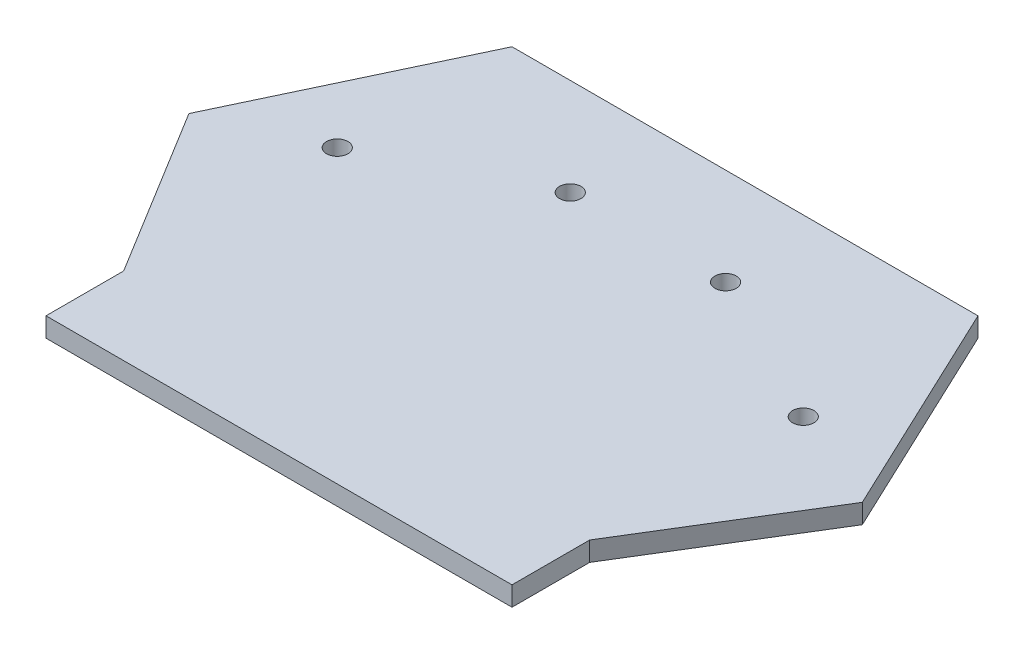
ISO-10303-21;
HEADER;
FILE_DESCRIPTION(('STEP AP214'),'2;1');
FILE_NAME('part.step','',(''),(''),'','','');
FILE_SCHEMA(('AUTOMOTIVE_DESIGN { 1 0 10303 214 1 1 1 1 }'));
ENDSEC;
DATA;
#1=APPLICATION_CONTEXT('core data for automotive mechanical design processes');
#2=APPLICATION_PROTOCOL_DEFINITION('international standard','automotive_design',2000,#1);
#3=PRODUCT_CONTEXT('',#1,'mechanical');
#4=PRODUCT('Part','Part','',(#3));
#5=PRODUCT_RELATED_PRODUCT_CATEGORY('part','',(#4));
#6=PRODUCT_DEFINITION_FORMATION('','',#4);
#7=PRODUCT_DEFINITION_CONTEXT('part definition',#1,'design');
#8=PRODUCT_DEFINITION('design','',#6,#7);
#9=PRODUCT_DEFINITION_SHAPE('','',#8);
#10=(LENGTH_UNIT() NAMED_UNIT(*) SI_UNIT(.MILLI.,.METRE.));
#11=(NAMED_UNIT(*) PLANE_ANGLE_UNIT() SI_UNIT($,.RADIAN.));
#12=(NAMED_UNIT(*) SI_UNIT($,.STERADIAN.) SOLID_ANGLE_UNIT());
#13=UNCERTAINTY_MEASURE_WITH_UNIT(LENGTH_MEASURE(1.E-05),#10,'distance_accuracy_value','');
#14=(GEOMETRIC_REPRESENTATION_CONTEXT(3) GLOBAL_UNCERTAINTY_ASSIGNED_CONTEXT((#13)) GLOBAL_UNIT_ASSIGNED_CONTEXT((#10,
#11,#12)) REPRESENTATION_CONTEXT('',''));
#15=CARTESIAN_POINT('',(0.,0.,0.));
#16=DIRECTION('',(0.,0.,1.));
#17=DIRECTION('',(1.,0.,0.));
#18=AXIS2_PLACEMENT_3D('',#15,#16,#17);
#19=CARTESIAN_POINT('',(-99.2676573240206,5.,-46.9170895914939));
#20=DIRECTION('',(-0.904105481449847,0.,-0.427309347443208));
#21=DIRECTION('',(-0.427309347443208,0.,0.904105481449847));
#22=AXIS2_PLACEMENT_3D('',#19,#20,#21);
#23=PLANE('',#22);
#24=DIRECTION('',(0.427309347443208,0.,-0.904105481449847));
#25=VECTOR('',#24,1.);
#26=CARTESIAN_POINT('',(-99.2676573240206,0.,-46.9170895914939));
#27=LINE('',#26,#25);
#28=CARTESIAN_POINT('',(-86.7010353286162,0.,-73.5056767528439));
#29=VERTEX_POINT('',#28);
#30=CARTESIAN_POINT('',(-60.,0.,-130.));
#31=VERTEX_POINT('',#30);
#32=EDGE_CURVE('E145',#29,#31,#27,.T.);
#33=ORIENTED_EDGE('',*,*,#32,.F.);
#34=DIRECTION('',(0.,-1.,0.));
#35=VECTOR('',#34,1.);
#36=CARTESIAN_POINT('',(-86.7010353286162,5.,-73.5056767528439));
#37=LINE('',#36,#35);
#38=CARTESIAN_POINT('',(-86.7010353286162,5.,-73.5056767528439));
#39=VERTEX_POINT('',#38);
#40=EDGE_CURVE('E11',#39,#29,#37,.T.);
#41=ORIENTED_EDGE('',*,*,#40,.F.);
#42=DIRECTION('',(0.427309347443208,0.,-0.904105481449847));
#43=VECTOR('',#42,1.);
#44=CARTESIAN_POINT('',(-99.2676573240206,5.,-46.9170895914939));
#45=LINE('',#44,#43);
#46=CARTESIAN_POINT('',(-60.,5.,-130.));
#47=VERTEX_POINT('',#46);
#48=EDGE_CURVE('E346',#39,#47,#45,.T.);
#49=ORIENTED_EDGE('',*,*,#48,.T.);
#50=DIRECTION('',(0.,-1.,0.));
#51=VECTOR('',#50,1.);
#52=CARTESIAN_POINT('',(-60.,5.,-130.));
#53=LINE('',#52,#51);
#54=EDGE_CURVE('E86',#47,#31,#53,.T.);
#55=ORIENTED_EDGE('',*,*,#54,.T.);
#56=EDGE_LOOP('',(#33,#41,#49,#55));
#57=FACE_BOUND('',#56,.T.);
#58=ADVANCED_FACE('F34',(#57),#23,.T.);
#59=CARTESIAN_POINT('',(-30.2089889709226,5.,18.5403685669975));
#60=DIRECTION('',(0.852284563233207,0.,-0.523078410254507));
#61=DIRECTION('',(-0.523078410254507,0.,-0.852284563233207));
#62=AXIS2_PLACEMENT_3D('',#59,#60,#61);
#63=PLANE('',#62);
#64=DIRECTION('',(0.523078410254507,0.,0.852284563233207));
#65=VECTOR('',#64,1.);
#66=CARTESIAN_POINT('',(-30.2089889709226,0.,18.5403685669975));
#67=LINE('',#66,#65);
#68=CARTESIAN_POINT('',(-60.,0.,-30.));
#69=VERTEX_POINT('',#68);
#70=EDGE_CURVE('E147',#29,#69,#67,.T.);
#71=ORIENTED_EDGE('',*,*,#70,.T.);
#72=DIRECTION('',(0.,-1.,0.));
#73=VECTOR('',#72,1.);
#74=CARTESIAN_POINT('',(-60.,5.,-30.));
#75=LINE('',#74,#73);
#76=CARTESIAN_POINT('',(-60.,5.,-30.));
#77=VERTEX_POINT('',#76);
#78=EDGE_CURVE('E43',#77,#69,#75,.T.);
#79=ORIENTED_EDGE('',*,*,#78,.F.);
#80=DIRECTION('',(0.523078410254507,0.,0.852284563233207));
#81=VECTOR('',#80,1.);
#82=CARTESIAN_POINT('',(-30.2089889709226,5.,18.5403685669975));
#83=LINE('',#82,#81);
#84=EDGE_CURVE('E344',#39,#77,#83,.T.);
#85=ORIENTED_EDGE('',*,*,#84,.F.);
#86=ORIENTED_EDGE('',*,*,#40,.T.);
#87=EDGE_LOOP('',(#71,#79,#85,#86));
#88=FACE_BOUND('',#87,.T.);
#89=ADVANCED_FACE('F187',(#88),#63,.F.);
#90=CARTESIAN_POINT('',(-60.,5.,0.));
#91=DIRECTION('',(1.,0.,0.));
#92=DIRECTION('',(0.,0.,-1.));
#93=AXIS2_PLACEMENT_3D('',#90,#91,#92);
#94=PLANE('',#93);
#95=DIRECTION('',(0.,0.,1.));
#96=VECTOR('',#95,1.);
#97=CARTESIAN_POINT('',(-60.,0.,0.));
#98=LINE('',#97,#96);
#99=CARTESIAN_POINT('',(-60.,0.,-9.99999999999999));
#100=VERTEX_POINT('',#99);
#101=EDGE_CURVE('E150',#69,#100,#98,.T.);
#102=ORIENTED_EDGE('',*,*,#101,.T.);
#103=DIRECTION('',(0.,-1.,0.));
#104=VECTOR('',#103,1.);
#105=CARTESIAN_POINT('',(-60.,5.,-9.99999999999999));
#106=LINE('',#105,#104);
#107=CARTESIAN_POINT('',(-60.,5.,-9.99999999999999));
#108=VERTEX_POINT('',#107);
#109=EDGE_CURVE('E175',#108,#100,#106,.T.);
#110=ORIENTED_EDGE('',*,*,#109,.F.);
#111=DIRECTION('',(0.,0.,1.));
#112=VECTOR('',#111,1.);
#113=CARTESIAN_POINT('',(-60.,5.,0.));
#114=LINE('',#113,#112);
#115=EDGE_CURVE('E183',#77,#108,#114,.T.);
#116=ORIENTED_EDGE('',*,*,#115,.F.);
#117=ORIENTED_EDGE('',*,*,#78,.T.);
#118=EDGE_LOOP('',(#102,#110,#116,#117));
#119=FACE_BOUND('',#118,.T.);
#120=ADVANCED_FACE('F180',(#119),#94,.F.);
#121=CARTESIAN_POINT('',(0.,5.,-9.99999999999999));
#122=DIRECTION('',(0.,0.,-1.));
#123=DIRECTION('',(-1.,0.,0.));
#124=AXIS2_PLACEMENT_3D('',#121,#122,#123);
#125=PLANE('',#124);
#126=DIRECTION('',(1.,0.,0.));
#127=VECTOR('',#126,1.);
#128=CARTESIAN_POINT('',(0.,0.,-9.99999999999999));
#129=LINE('',#128,#127);
#130=CARTESIAN_POINT('',(60.,0.,-9.99999999999999));
#131=VERTEX_POINT('',#130);
#132=EDGE_CURVE('E153',#100,#131,#129,.T.);
#133=ORIENTED_EDGE('',*,*,#132,.T.);
#134=DIRECTION('',(0.,-1.,0.));
#135=VECTOR('',#134,1.);
#136=CARTESIAN_POINT('',(60.,5.,-9.99999999999999));
#137=LINE('',#136,#135);
#138=CARTESIAN_POINT('',(60.,5.,-9.99999999999999));
#139=VERTEX_POINT('',#138);
#140=EDGE_CURVE('E173',#139,#131,#137,.T.);
#141=ORIENTED_EDGE('',*,*,#140,.F.);
#142=DIRECTION('',(1.,0.,0.));
#143=VECTOR('',#142,1.);
#144=CARTESIAN_POINT('',(0.,5.,-9.99999999999999));
#145=LINE('',#144,#143);
#146=EDGE_CURVE('E128',#108,#139,#145,.T.);
#147=ORIENTED_EDGE('',*,*,#146,.F.);
#148=ORIENTED_EDGE('',*,*,#109,.T.);
#149=EDGE_LOOP('',(#133,#141,#147,#148));
#150=FACE_BOUND('',#149,.T.);
#151=ADVANCED_FACE('F238',(#150),#125,.F.);
#152=CARTESIAN_POINT('',(60.,5.,0.));
#153=DIRECTION('',(1.,0.,0.));
#154=DIRECTION('',(0.,0.,-1.));
#155=AXIS2_PLACEMENT_3D('',#152,#153,#154);
#156=PLANE('',#155);
#157=DIRECTION('',(0.,0.,1.));
#158=VECTOR('',#157,1.);
#159=CARTESIAN_POINT('',(60.,0.,0.));
#160=LINE('',#159,#158);
#161=CARTESIAN_POINT('',(60.,0.,-30.));
#162=VERTEX_POINT('',#161);
#163=EDGE_CURVE('E156',#162,#131,#160,.T.);
#164=ORIENTED_EDGE('',*,*,#163,.F.);
#165=DIRECTION('',(0.,-1.,0.));
#166=VECTOR('',#165,1.);
#167=CARTESIAN_POINT('',(60.,5.,-30.));
#168=LINE('',#167,#166);
#169=CARTESIAN_POINT('',(60.,5.,-30.));
#170=VERTEX_POINT('',#169);
#171=EDGE_CURVE('E115',#170,#162,#168,.T.);
#172=ORIENTED_EDGE('',*,*,#171,.F.);
#173=DIRECTION('',(0.,0.,1.));
#174=VECTOR('',#173,1.);
#175=CARTESIAN_POINT('',(60.,5.,0.));
#176=LINE('',#175,#174);
#177=EDGE_CURVE('E126',#170,#139,#176,.T.);
#178=ORIENTED_EDGE('',*,*,#177,.T.);
#179=ORIENTED_EDGE('',*,*,#140,.T.);
#180=EDGE_LOOP('',(#164,#172,#178,#179));
#181=FACE_BOUND('',#180,.T.);
#182=ADVANCED_FACE('F235',(#181),#156,.T.);
#183=CARTESIAN_POINT('',(30.2089889709226,5.,18.5403685669975));
#184=DIRECTION('',(0.852284563233207,0.,0.523078410254507));
#185=DIRECTION('',(0.523078410254507,0.,-0.852284563233207));
#186=AXIS2_PLACEMENT_3D('',#183,#184,#185);
#187=PLANE('',#186);
#188=DIRECTION('',(-0.523078410254507,0.,0.852284563233207));
#189=VECTOR('',#188,1.);
#190=CARTESIAN_POINT('',(30.2089889709226,0.,18.5403685669975));
#191=LINE('',#190,#189);
#192=CARTESIAN_POINT('',(86.7010353286162,0.,-73.5056767528439));
#193=VERTEX_POINT('',#192);
#194=EDGE_CURVE('E112',#193,#162,#191,.T.);
#195=ORIENTED_EDGE('',*,*,#194,.F.);
#196=DIRECTION('',(0.,-1.,0.));
#197=VECTOR('',#196,1.);
#198=CARTESIAN_POINT('',(86.7010353286162,5.,-73.5056767528439));
#199=LINE('',#198,#197);
#200=CARTESIAN_POINT('',(86.7010353286162,5.,-73.5056767528439));
#201=VERTEX_POINT('',#200);
#202=EDGE_CURVE('E106',#201,#193,#199,.T.);
#203=ORIENTED_EDGE('',*,*,#202,.F.);
#204=DIRECTION('',(-0.523078410254507,0.,0.852284563233207));
#205=VECTOR('',#204,1.);
#206=CARTESIAN_POINT('',(30.2089889709226,5.,18.5403685669975));
#207=LINE('',#206,#205);
#208=EDGE_CURVE('E110',#201,#170,#207,.T.);
#209=ORIENTED_EDGE('',*,*,#208,.T.);
#210=ORIENTED_EDGE('',*,*,#171,.T.);
#211=EDGE_LOOP('',(#195,#203,#209,#210));
#212=FACE_BOUND('',#211,.T.);
#213=ADVANCED_FACE('F108',(#212),#187,.T.);
#214=CARTESIAN_POINT('',(99.2676573240206,5.,-46.9170895914939));
#215=DIRECTION('',(-0.904105481449847,0.,0.427309347443208));
#216=DIRECTION('',(0.427309347443208,0.,0.904105481449847));
#217=AXIS2_PLACEMENT_3D('',#214,#215,#216);
#218=PLANE('',#217);
#219=DIRECTION('',(-0.427309347443208,0.,-0.904105481449847));
#220=VECTOR('',#219,1.);
#221=CARTESIAN_POINT('',(99.2676573240206,0.,-46.9170895914939));
#222=LINE('',#221,#220);
#223=CARTESIAN_POINT('',(60.,0.,-130.));
#224=VERTEX_POINT('',#223);
#225=EDGE_CURVE('E160',#193,#224,#222,.T.);
#226=ORIENTED_EDGE('',*,*,#225,.T.);
#227=DIRECTION('',(0.,-1.,0.));
#228=VECTOR('',#227,1.);
#229=CARTESIAN_POINT('',(60.,5.,-130.));
#230=LINE('',#229,#228);
#231=CARTESIAN_POINT('',(60.,5.,-130.));
#232=VERTEX_POINT('',#231);
#233=EDGE_CURVE('E116',#232,#224,#230,.T.);
#234=ORIENTED_EDGE('',*,*,#233,.F.);
#235=DIRECTION('',(-0.427309347443208,0.,-0.904105481449847));
#236=VECTOR('',#235,1.);
#237=CARTESIAN_POINT('',(99.2676573240206,5.,-46.9170895914939));
#238=LINE('',#237,#236);
#239=EDGE_CURVE('E119',#201,#232,#238,.T.);
#240=ORIENTED_EDGE('',*,*,#239,.F.);
#241=ORIENTED_EDGE('',*,*,#202,.T.);
#242=EDGE_LOOP('',(#226,#234,#240,#241));
#243=FACE_BOUND('',#242,.T.);
#244=ADVANCED_FACE('F120',(#243),#218,.F.);
#245=CARTESIAN_POINT('',(60.,5.,-85.));
#246=DIRECTION('',(0.,-1.,0.));
#247=DIRECTION('',(0.,0.,-1.));
#248=AXIS2_PLACEMENT_3D('',#245,#246,#247);
#249=CYLINDRICAL_SURFACE('',#248,2.75);
#250=CARTESIAN_POINT('',(60.,5.,-85.));
#251=DIRECTION('',(0.,1.,0.));
#252=DIRECTION('',(0.,0.,1.));
#253=AXIS2_PLACEMENT_3D('',#250,#251,#252);
#254=CIRCLE('',#253,2.75);
#255=CARTESIAN_POINT('',(60.,5.,-82.25));
#256=VERTEX_POINT('',#255);
#257=EDGE_CURVE('E133',#256,#256,#254,.F.);
#258=ORIENTED_EDGE('',*,*,#257,.F.);
#259=EDGE_LOOP('',(#258));
#260=FACE_BOUND('',#259,.T.);
#261=CARTESIAN_POINT('',(60.,0.,-85.));
#262=DIRECTION('',(0.,1.,0.));
#263=DIRECTION('',(0.,0.,1.));
#264=AXIS2_PLACEMENT_3D('',#261,#262,#263);
#265=CIRCLE('',#264,2.75);
#266=CARTESIAN_POINT('',(60.,0.,-82.25));
#267=VERTEX_POINT('',#266);
#268=EDGE_CURVE('E163',#267,#267,#265,.F.);
#269=ORIENTED_EDGE('',*,*,#268,.T.);
#270=EDGE_LOOP('',(#269));
#271=FACE_BOUND('',#270,.T.);
#272=ADVANCED_FACE('F207',(#260,#271),#249,.F.);
#273=CARTESIAN_POINT('',(0.,5.,-130.));
#274=DIRECTION('',(0.,0.,1.));
#275=DIRECTION('',(1.,0.,0.));
#276=AXIS2_PLACEMENT_3D('',#273,#274,#275);
#277=PLANE('',#276);
#278=DIRECTION('',(-1.,0.,0.));
#279=VECTOR('',#278,1.);
#280=CARTESIAN_POINT('',(0.,0.,-130.));
#281=LINE('',#280,#279);
#282=EDGE_CURVE('E79',#224,#31,#281,.T.);
#283=ORIENTED_EDGE('',*,*,#282,.T.);
#284=ORIENTED_EDGE('',*,*,#54,.F.);
#285=DIRECTION('',(-1.,0.,0.));
#286=VECTOR('',#285,1.);
#287=CARTESIAN_POINT('',(0.,5.,-130.));
#288=LINE('',#287,#286);
#289=EDGE_CURVE('E51',#232,#47,#288,.T.);
#290=ORIENTED_EDGE('',*,*,#289,.F.);
#291=ORIENTED_EDGE('',*,*,#233,.T.);
#292=EDGE_LOOP('',(#283,#284,#290,#291));
#293=FACE_BOUND('',#292,.T.);
#294=ADVANCED_FACE('F199',(#293),#277,.F.);
#295=CARTESIAN_POINT('',(-20.,5.,-105.));
#296=DIRECTION('',(0.,-1.,0.));
#297=DIRECTION('',(0.,0.,-1.));
#298=AXIS2_PLACEMENT_3D('',#295,#296,#297);
#299=CYLINDRICAL_SURFACE('',#298,2.75);
#300=CARTESIAN_POINT('',(-20.,5.,-105.));
#301=DIRECTION('',(0.,1.,0.));
#302=DIRECTION('',(0.,0.,1.));
#303=AXIS2_PLACEMENT_3D('',#300,#301,#302);
#304=CIRCLE('',#303,2.75);
#305=CARTESIAN_POINT('',(-20.,5.,-102.25));
#306=VERTEX_POINT('',#305);
#307=EDGE_CURVE('E213',#306,#306,#304,.T.);
#308=ORIENTED_EDGE('',*,*,#307,.T.);
#309=EDGE_LOOP('',(#308));
#310=FACE_BOUND('',#309,.T.);
#311=CARTESIAN_POINT('',(-20.,0.,-105.));
#312=DIRECTION('',(0.,1.,0.));
#313=DIRECTION('',(0.,0.,1.));
#314=AXIS2_PLACEMENT_3D('',#311,#312,#313);
#315=CIRCLE('',#314,2.75);
#316=CARTESIAN_POINT('',(-20.,0.,-102.25));
#317=VERTEX_POINT('',#316);
#318=EDGE_CURVE('E142',#317,#317,#315,.T.);
#319=ORIENTED_EDGE('',*,*,#318,.F.);
#320=EDGE_LOOP('',(#319));
#321=FACE_BOUND('',#320,.T.);
#322=ADVANCED_FACE('F197',(#310,#321),#299,.F.);
#323=CARTESIAN_POINT('',(-60.,5.,-85.));
#324=DIRECTION('',(0.,-1.,0.));
#325=DIRECTION('',(0.,0.,-1.));
#326=AXIS2_PLACEMENT_3D('',#323,#324,#325);
#327=CYLINDRICAL_SURFACE('',#326,2.75);
#328=CARTESIAN_POINT('',(-60.,5.,-85.));
#329=DIRECTION('',(0.,1.,0.));
#330=DIRECTION('',(0.,0.,1.));
#331=AXIS2_PLACEMENT_3D('',#328,#329,#330);
#332=CIRCLE('',#331,2.75);
#333=CARTESIAN_POINT('',(-60.,5.,-82.25));
#334=VERTEX_POINT('',#333);
#335=EDGE_CURVE('E169',#334,#334,#332,.T.);
#336=ORIENTED_EDGE('',*,*,#335,.T.);
#337=EDGE_LOOP('',(#336));
#338=FACE_BOUND('',#337,.T.);
#339=CARTESIAN_POINT('',(-60.,0.,-85.));
#340=DIRECTION('',(0.,1.,0.));
#341=DIRECTION('',(0.,0.,1.));
#342=AXIS2_PLACEMENT_3D('',#339,#340,#341);
#343=CIRCLE('',#342,2.75);
#344=CARTESIAN_POINT('',(-60.,0.,-82.25));
#345=VERTEX_POINT('',#344);
#346=EDGE_CURVE('E139',#345,#345,#343,.T.);
#347=ORIENTED_EDGE('',*,*,#346,.F.);
#348=EDGE_LOOP('',(#347));
#349=FACE_BOUND('',#348,.T.);
#350=ADVANCED_FACE('F36',(#338,#349),#327,.F.);
#351=CARTESIAN_POINT('',(20.,5.,-105.));
#352=DIRECTION('',(0.,-1.,0.));
#353=DIRECTION('',(0.,0.,-1.));
#354=AXIS2_PLACEMENT_3D('',#351,#352,#353);
#355=CYLINDRICAL_SURFACE('',#354,2.75);
#356=CARTESIAN_POINT('',(20.,5.,-105.));
#357=DIRECTION('',(0.,1.,0.));
#358=DIRECTION('',(0.,0.,1.));
#359=AXIS2_PLACEMENT_3D('',#356,#357,#358);
#360=CIRCLE('',#359,2.75);
#361=CARTESIAN_POINT('',(20.,5.,-102.25));
#362=VERTEX_POINT('',#361);
#363=EDGE_CURVE('E136',#362,#362,#360,.F.);
#364=ORIENTED_EDGE('',*,*,#363,.F.);
#365=EDGE_LOOP('',(#364));
#366=FACE_BOUND('',#365,.T.);
#367=CARTESIAN_POINT('',(20.,0.,-105.));
#368=DIRECTION('',(0.,1.,0.));
#369=DIRECTION('',(0.,0.,1.));
#370=AXIS2_PLACEMENT_3D('',#367,#368,#369);
#371=CIRCLE('',#370,2.75);
#372=CARTESIAN_POINT('',(20.,0.,-102.25));
#373=VERTEX_POINT('',#372);
#374=EDGE_CURVE('E166',#373,#373,#371,.F.);
#375=ORIENTED_EDGE('',*,*,#374,.T.);
#376=EDGE_LOOP('',(#375));
#377=FACE_BOUND('',#376,.T.);
#378=ADVANCED_FACE('F205',(#366,#377),#355,.F.);
#379=CARTESIAN_POINT('',(0.,5.,0.));
#380=DIRECTION('',(0.,1.,0.));
#381=DIRECTION('',(0.,0.,1.));
#382=AXIS2_PLACEMENT_3D('',#379,#380,#381);
#383=PLANE('',#382);
#384=ORIENTED_EDGE('',*,*,#335,.F.);
#385=EDGE_LOOP('',(#384));
#386=FACE_BOUND('',#385,.T.);
#387=ORIENTED_EDGE('',*,*,#307,.F.);
#388=EDGE_LOOP('',(#387));
#389=FACE_BOUND('',#388,.T.);
#390=ORIENTED_EDGE('',*,*,#48,.F.);
#391=ORIENTED_EDGE('',*,*,#84,.T.);
#392=ORIENTED_EDGE('',*,*,#115,.T.);
#393=ORIENTED_EDGE('',*,*,#146,.T.);
#394=ORIENTED_EDGE('',*,*,#177,.F.);
#395=ORIENTED_EDGE('',*,*,#208,.F.);
#396=ORIENTED_EDGE('',*,*,#239,.T.);
#397=ORIENTED_EDGE('',*,*,#289,.T.);
#398=EDGE_LOOP('',(#390,#391,#392,#393,#394,#395,#396,#397));
#399=FACE_BOUND('',#398,.T.);
#400=ORIENTED_EDGE('',*,*,#257,.T.);
#401=EDGE_LOOP('',(#400));
#402=FACE_BOUND('',#401,.T.);
#403=ORIENTED_EDGE('',*,*,#363,.T.);
#404=EDGE_LOOP('',(#403));
#405=FACE_BOUND('',#404,.T.);
#406=ADVANCED_FACE('F123',(#386,#389,#399,#402,#405),#383,.T.);
#407=CARTESIAN_POINT('',(0.,0.,0.));
#408=DIRECTION('',(0.,1.,0.));
#409=DIRECTION('',(0.,0.,1.));
#410=AXIS2_PLACEMENT_3D('',#407,#408,#409);
#411=PLANE('',#410);
#412=ORIENTED_EDGE('',*,*,#346,.T.);
#413=EDGE_LOOP('',(#412));
#414=FACE_BOUND('',#413,.T.);
#415=ORIENTED_EDGE('',*,*,#318,.T.);
#416=EDGE_LOOP('',(#415));
#417=FACE_BOUND('',#416,.T.);
#418=ORIENTED_EDGE('',*,*,#32,.T.);
#419=ORIENTED_EDGE('',*,*,#282,.F.);
#420=ORIENTED_EDGE('',*,*,#225,.F.);
#421=ORIENTED_EDGE('',*,*,#194,.T.);
#422=ORIENTED_EDGE('',*,*,#163,.T.);
#423=ORIENTED_EDGE('',*,*,#132,.F.);
#424=ORIENTED_EDGE('',*,*,#101,.F.);
#425=ORIENTED_EDGE('',*,*,#70,.F.);
#426=EDGE_LOOP('',(#418,#419,#420,#421,#422,#423,#424,#425));
#427=FACE_BOUND('',#426,.T.);
#428=ORIENTED_EDGE('',*,*,#268,.F.);
#429=EDGE_LOOP('',(#428));
#430=FACE_BOUND('',#429,.T.);
#431=ORIENTED_EDGE('',*,*,#374,.F.);
#432=EDGE_LOOP('',(#431));
#433=FACE_BOUND('',#432,.T.);
#434=ADVANCED_FACE('F188',(#414,#417,#427,#430,#433),#411,.F.);
#435=CLOSED_SHELL('',(#58,#89,#120,#151,#182,#213,#244,#272,#294,#322,#350,#378,#406,#434));
#436=MANIFOLD_SOLID_BREP('B2',#435);
#437=ADVANCED_BREP_SHAPE_REPRESENTATION('',(#18,#436),#14);
#438=SHAPE_DEFINITION_REPRESENTATION(#9,#437);
ENDSEC;
END-ISO-10303-21;
